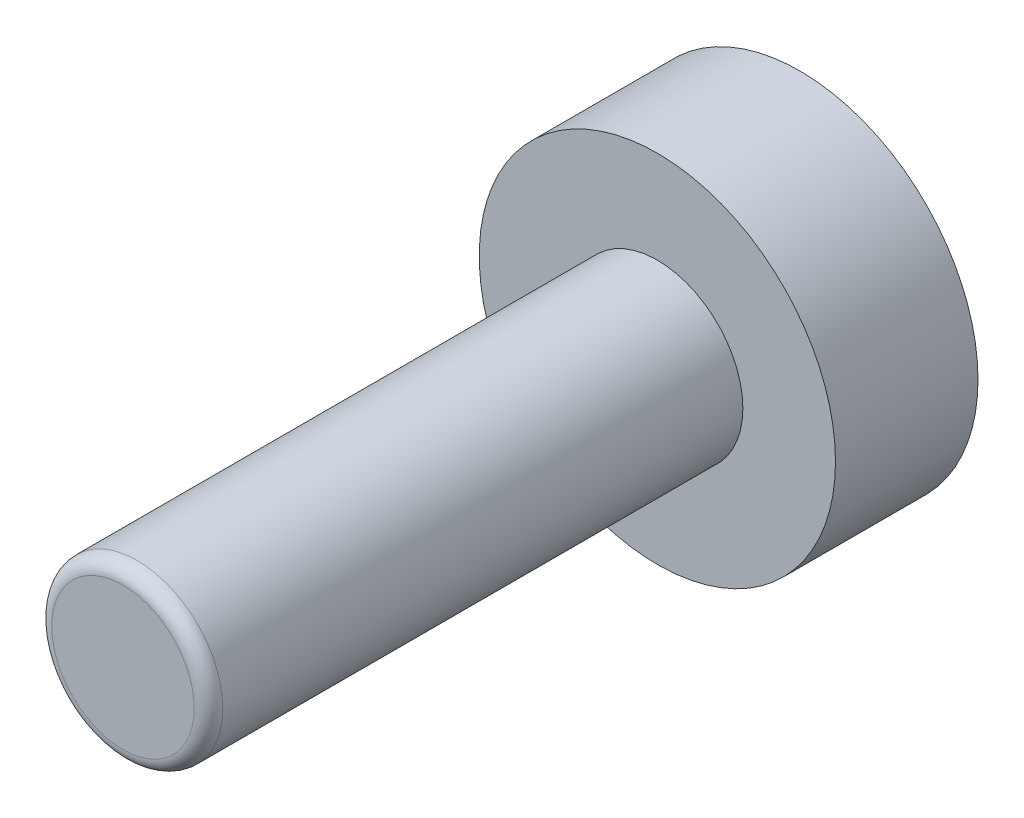
ISO-10303-21;
HEADER;
FILE_DESCRIPTION(('STEP AP214'),'2;1');
FILE_NAME('part.step','',(''),(''),'','','');
FILE_SCHEMA(('AUTOMOTIVE_DESIGN { 1 0 10303 214 1 1 1 1 }'));
ENDSEC;
DATA;
#1=APPLICATION_CONTEXT('core data for automotive mechanical design processes');
#2=APPLICATION_PROTOCOL_DEFINITION('international standard','automotive_design',2000,#1);
#3=PRODUCT_CONTEXT('',#1,'mechanical');
#4=PRODUCT('Part','Part','',(#3));
#5=PRODUCT_RELATED_PRODUCT_CATEGORY('part','',(#4));
#6=PRODUCT_DEFINITION_FORMATION('','',#4);
#7=PRODUCT_DEFINITION_CONTEXT('part definition',#1,'design');
#8=PRODUCT_DEFINITION('design','',#6,#7);
#9=PRODUCT_DEFINITION_SHAPE('','',#8);
#10=(LENGTH_UNIT() NAMED_UNIT(*) SI_UNIT(.MILLI.,.METRE.));
#11=(NAMED_UNIT(*) PLANE_ANGLE_UNIT() SI_UNIT($,.RADIAN.));
#12=(NAMED_UNIT(*) SI_UNIT($,.STERADIAN.) SOLID_ANGLE_UNIT());
#13=UNCERTAINTY_MEASURE_WITH_UNIT(LENGTH_MEASURE(1.E-05),#10,'distance_accuracy_value','');
#14=(GEOMETRIC_REPRESENTATION_CONTEXT(3) GLOBAL_UNCERTAINTY_ASSIGNED_CONTEXT((#13)) GLOBAL_UNIT_ASSIGNED_CONTEXT((#10,
#11,#12)) REPRESENTATION_CONTEXT('',''));
#15=CARTESIAN_POINT('',(0.,0.,0.));
#16=DIRECTION('',(0.,0.,1.));
#17=DIRECTION('',(1.,0.,0.));
#18=AXIS2_PLACEMENT_3D('',#15,#16,#17);
#19=CARTESIAN_POINT('',(0.,0.,4.));
#20=DIRECTION('',(0.,0.,1.));
#21=DIRECTION('',(1.,0.,0.));
#22=AXIS2_PLACEMENT_3D('',#19,#20,#21);
#23=PLANE('',#22);
#24=CARTESIAN_POINT('',(0.,0.,4.));
#25=DIRECTION('',(0.,0.,1.));
#26=DIRECTION('',(1.,0.,0.));
#27=AXIS2_PLACEMENT_3D('',#24,#25,#26);
#28=CIRCLE('',#27,5.);
#29=CARTESIAN_POINT('',(5.,0.,4.));
#30=VERTEX_POINT('',#29);
#31=EDGE_CURVE('E42',#30,#30,#28,.T.);
#32=ORIENTED_EDGE('',*,*,#31,.T.);
#33=EDGE_LOOP('',(#32));
#34=FACE_BOUND('',#33,.T.);
#35=CARTESIAN_POINT('',(0.,0.,4.));
#36=DIRECTION('',(0.,0.,1.));
#37=DIRECTION('',(1.,0.,0.));
#38=AXIS2_PLACEMENT_3D('',#35,#36,#37);
#39=CIRCLE('',#38,2.4);
#40=CARTESIAN_POINT('',(2.4,0.,4.));
#41=VERTEX_POINT('',#40);
#42=EDGE_CURVE('E50',#41,#41,#39,.T.);
#43=ORIENTED_EDGE('',*,*,#42,.F.);
#44=EDGE_LOOP('',(#43));
#45=FACE_BOUND('',#44,.T.);
#46=ADVANCED_FACE('F31',(#34,#45),#23,.T.);
#47=CARTESIAN_POINT('',(0.,0.,4.));
#48=DIRECTION('',(0.,0.,-1.));
#49=DIRECTION('',(-1.,0.,0.));
#50=AXIS2_PLACEMENT_3D('',#47,#48,#49);
#51=CYLINDRICAL_SURFACE('',#50,5.);
#52=ORIENTED_EDGE('',*,*,#31,.F.);
#53=EDGE_LOOP('',(#52));
#54=FACE_BOUND('',#53,.T.);
#55=CARTESIAN_POINT('',(0.,0.,0.));
#56=DIRECTION('',(0.,0.,1.));
#57=DIRECTION('',(1.,0.,0.));
#58=AXIS2_PLACEMENT_3D('',#55,#56,#57);
#59=CIRCLE('',#58,5.);
#60=CARTESIAN_POINT('',(5.,0.,0.));
#61=VERTEX_POINT('',#60);
#62=EDGE_CURVE('E46',#61,#61,#59,.T.);
#63=ORIENTED_EDGE('',*,*,#62,.T.);
#64=EDGE_LOOP('',(#63));
#65=FACE_BOUND('',#64,.T.);
#66=ADVANCED_FACE('F58',(#54,#65),#51,.T.);
#67=CARTESIAN_POINT('',(0.,0.,0.));
#68=DIRECTION('',(0.,0.,1.));
#69=DIRECTION('',(1.,0.,0.));
#70=AXIS2_PLACEMENT_3D('',#67,#68,#69);
#71=PLANE('',#70);
#72=ORIENTED_EDGE('',*,*,#62,.F.);
#73=EDGE_LOOP('',(#72));
#74=FACE_BOUND('',#73,.T.);
#75=ADVANCED_FACE('F64',(#74),#71,.F.);
#76=CARTESIAN_POINT('',(0.,0.,19.));
#77=DIRECTION('',(0.,0.,-1.));
#78=DIRECTION('',(-1.,0.,0.));
#79=AXIS2_PLACEMENT_3D('',#76,#77,#78);
#80=CYLINDRICAL_SURFACE('',#79,2.4);
#81=CARTESIAN_POINT('',(0.,0.,18.6));
#82=DIRECTION('',(0.,0.,1.));
#83=DIRECTION('',(1.,0.,0.));
#84=AXIS2_PLACEMENT_3D('',#81,#82,#83);
#85=CIRCLE('',#84,2.4);
#86=CARTESIAN_POINT('',(2.4,0.,18.6));
#87=VERTEX_POINT('',#86);
#88=EDGE_CURVE('E10',#87,#87,#85,.F.);
#89=ORIENTED_EDGE('',*,*,#88,.T.);
#90=EDGE_LOOP('',(#89));
#91=FACE_BOUND('',#90,.T.);
#92=ORIENTED_EDGE('',*,*,#42,.T.);
#93=EDGE_LOOP('',(#92));
#94=FACE_BOUND('',#93,.T.);
#95=ADVANCED_FACE('F55',(#91,#94),#80,.T.);
#96=CARTESIAN_POINT('',(0.,0.,19.));
#97=DIRECTION('',(0.,0.,1.));
#98=DIRECTION('',(1.,0.,0.));
#99=AXIS2_PLACEMENT_3D('',#96,#97,#98);
#100=PLANE('',#99);
#101=CARTESIAN_POINT('',(0.,0.,19.));
#102=DIRECTION('',(0.,0.,1.));
#103=DIRECTION('',(1.,0.,0.));
#104=AXIS2_PLACEMENT_3D('',#101,#102,#103);
#105=CIRCLE('',#104,2.);
#106=CARTESIAN_POINT('',(2.,0.,19.));
#107=VERTEX_POINT('',#106);
#108=EDGE_CURVE('E38',#107,#107,#105,.T.);
#109=ORIENTED_EDGE('',*,*,#108,.T.);
#110=EDGE_LOOP('',(#109));
#111=FACE_BOUND('',#110,.T.);
#112=ADVANCED_FACE('F74',(#111),#100,.T.);
#113=CARTESIAN_POINT('',(0.,0.,18.6));
#114=DIRECTION('',(0.,0.,1.));
#115=DIRECTION('',(1.,0.,0.));
#116=AXIS2_PLACEMENT_3D('',#113,#114,#115);
#117=TOROIDAL_SURFACE('',#116,2.,0.399999999999999);
#118=ORIENTED_EDGE('',*,*,#88,.F.);
#119=EDGE_LOOP('',(#118));
#120=FACE_BOUND('',#119,.T.);
#121=ORIENTED_EDGE('',*,*,#108,.F.);
#122=EDGE_LOOP('',(#121));
#123=FACE_BOUND('',#122,.T.);
#124=ADVANCED_FACE('F33',(#120,#123),#117,.T.);
#125=CLOSED_SHELL('',(#46,#66,#75,#95,#112,#124));
#126=MANIFOLD_SOLID_BREP('B2',#125);
#127=ADVANCED_BREP_SHAPE_REPRESENTATION('',(#18,#126),#14);
#128=SHAPE_DEFINITION_REPRESENTATION(#9,#127);
ENDSEC;
END-ISO-10303-21;
